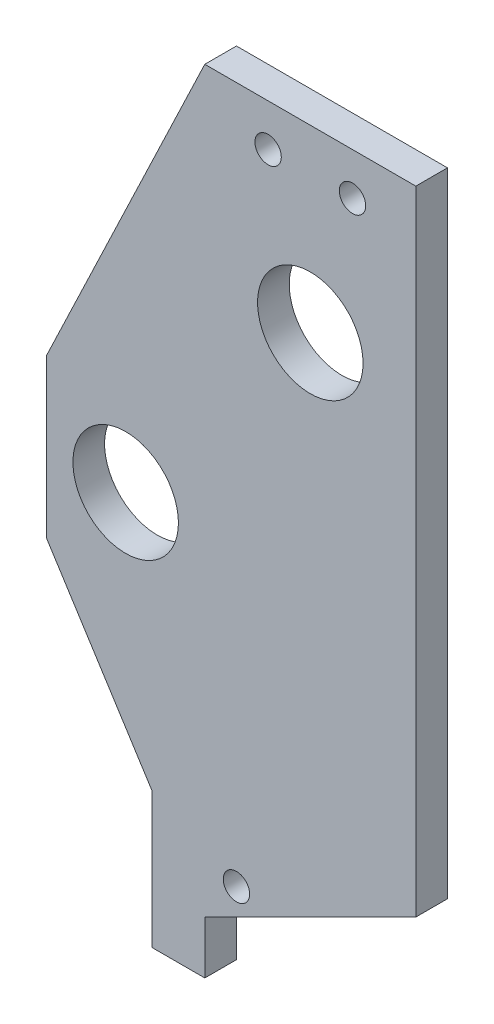
ISO-10303-21;
HEADER;
FILE_DESCRIPTION(('STEP AP214'),'2;1');
FILE_NAME('part.step','',(''),(''),'','','');
FILE_SCHEMA(('AUTOMOTIVE_DESIGN { 1 0 10303 214 1 1 1 1 }'));
ENDSEC;
DATA;
#1=APPLICATION_CONTEXT('core data for automotive mechanical design processes');
#2=APPLICATION_PROTOCOL_DEFINITION('international standard','automotive_design',2000,#1);
#3=PRODUCT_CONTEXT('',#1,'mechanical');
#4=PRODUCT('Part','Part','',(#3));
#5=PRODUCT_RELATED_PRODUCT_CATEGORY('part','',(#4));
#6=PRODUCT_DEFINITION_FORMATION('','',#4);
#7=PRODUCT_DEFINITION_CONTEXT('part definition',#1,'design');
#8=PRODUCT_DEFINITION('design','',#6,#7);
#9=PRODUCT_DEFINITION_SHAPE('','',#8);
#10=(LENGTH_UNIT() NAMED_UNIT(*) SI_UNIT(.MILLI.,.METRE.));
#11=(NAMED_UNIT(*) PLANE_ANGLE_UNIT() SI_UNIT($,.RADIAN.));
#12=(NAMED_UNIT(*) SI_UNIT($,.STERADIAN.) SOLID_ANGLE_UNIT());
#13=UNCERTAINTY_MEASURE_WITH_UNIT(LENGTH_MEASURE(1.E-05),#10,'distance_accuracy_value','');
#14=(GEOMETRIC_REPRESENTATION_CONTEXT(3) GLOBAL_UNCERTAINTY_ASSIGNED_CONTEXT((#13)) GLOBAL_UNIT_ASSIGNED_CONTEXT((#10,
#11,#12)) REPRESENTATION_CONTEXT('',''));
#15=CARTESIAN_POINT('',(0.,0.,0.));
#16=DIRECTION('',(0.,0.,1.));
#17=DIRECTION('',(1.,0.,0.));
#18=AXIS2_PLACEMENT_3D('',#15,#16,#17);
#19=CARTESIAN_POINT('',(-16.2047744499908,-40.1770428914772,0.));
#20=DIRECTION('',(-0.84395586185046,-0.536412624057496,0.));
#21=DIRECTION('',(0.536412624057496,-0.84395586185046,0.));
#22=AXIS2_PLACEMENT_3D('',#19,#20,#21);
#23=PLANE('',#22);
#24=DIRECTION('',(0.536412624057495,-0.843955861850459,0.));
#25=VECTOR('',#24,1.);
#26=CARTESIAN_POINT('',(-16.2047744499908,-40.1770428914772,0.));
#27=LINE('',#26,#25);
#28=CARTESIAN_POINT('',(-31.2047744499908,-16.5770428914772,0.));
#29=VERTEX_POINT('',#28);
#30=CARTESIAN_POINT('',(-21.2047744499908,-32.3103762248105,0.));
#31=VERTEX_POINT('',#30);
#32=EDGE_CURVE('E143',#29,#31,#27,.T.);
#33=ORIENTED_EDGE('',*,*,#32,.T.);
#34=DIRECTION('',(0.,0.,1.));
#35=VECTOR('',#34,1.);
#36=CARTESIAN_POINT('',(-21.2047744499908,-32.3103762248105,0.));
#37=LINE('',#36,#35);
#38=CARTESIAN_POINT('',(-21.2047744499908,-32.3103762248105,3.));
#39=VERTEX_POINT('',#38);
#40=EDGE_CURVE('E183',#31,#39,#37,.T.);
#41=ORIENTED_EDGE('',*,*,#40,.T.);
#42=DIRECTION('',(0.536412624057495,-0.843955861850459,0.));
#43=VECTOR('',#42,1.);
#44=CARTESIAN_POINT('',(-16.2047744499908,-40.1770428914772,3.));
#45=LINE('',#44,#43);
#46=CARTESIAN_POINT('',(-31.2047744499908,-16.5770428914772,3.));
#47=VERTEX_POINT('',#46);
#48=EDGE_CURVE('E139',#47,#39,#45,.T.);
#49=ORIENTED_EDGE('',*,*,#48,.F.);
#50=DIRECTION('',(0.,0.,1.));
#51=VECTOR('',#50,1.);
#52=CARTESIAN_POINT('',(-31.2047744499908,-16.5770428914772,0.));
#53=LINE('',#52,#51);
#54=EDGE_CURVE('E135',#29,#47,#53,.T.);
#55=ORIENTED_EDGE('',*,*,#54,.F.);
#56=EDGE_LOOP('',(#33,#41,#49,#55));
#57=FACE_BOUND('',#56,.T.);
#58=ADVANCED_FACE('F32',(#57),#23,.T.);
#59=CARTESIAN_POINT('',(3.79522555000924,29.8229571085228,3.));
#60=DIRECTION('',(-1.,0.,0.));
#61=DIRECTION('',(0.,-1.,0.));
#62=AXIS2_PLACEMENT_3D('',#59,#60,#61);
#63=PLANE('',#62);
#64=DIRECTION('',(0.,1.,0.));
#65=VECTOR('',#64,1.);
#66=CARTESIAN_POINT('',(3.79522555000924,29.8229571085228,3.));
#67=LINE('',#66,#65);
#68=CARTESIAN_POINT('',(3.79522555000921,-30.1770428914772,3.));
#69=VERTEX_POINT('',#68);
#70=CARTESIAN_POINT('',(3.79522555000924,29.8229571085228,3.));
#71=VERTEX_POINT('',#70);
#72=EDGE_CURVE('E58',#69,#71,#67,.T.);
#73=ORIENTED_EDGE('',*,*,#72,.F.);
#74=DIRECTION('',(0.,0.,1.));
#75=VECTOR('',#74,1.);
#76=CARTESIAN_POINT('',(3.79522555000921,-30.1770428914772,-5.00000000001367E-05));
#77=LINE('',#76,#75);
#78=CARTESIAN_POINT('',(3.79522555000921,-30.1770428914772,0.));
#79=VERTEX_POINT('',#78);
#80=EDGE_CURVE('E105',#79,#69,#77,.T.);
#81=ORIENTED_EDGE('',*,*,#80,.F.);
#82=DIRECTION('',(0.,1.,0.));
#83=VECTOR('',#82,1.);
#84=CARTESIAN_POINT('',(3.79522555000924,29.8229571085228,0.));
#85=LINE('',#84,#83);
#86=CARTESIAN_POINT('',(3.79522555000924,29.8229571085228,0.));
#87=VERTEX_POINT('',#86);
#88=EDGE_CURVE('E129',#79,#87,#85,.T.);
#89=ORIENTED_EDGE('',*,*,#88,.T.);
#90=DIRECTION('',(0.,0.,-1.));
#91=VECTOR('',#90,1.);
#92=CARTESIAN_POINT('',(3.79522555000924,29.8229571085228,3.));
#93=LINE('',#92,#91);
#94=EDGE_CURVE('E41',#71,#87,#93,.T.);
#95=ORIENTED_EDGE('',*,*,#94,.F.);
#96=EDGE_LOOP('',(#73,#81,#89,#95));
#97=FACE_BOUND('',#96,.T.);
#98=ADVANCED_FACE('F34',(#97),#63,.F.);
#99=CARTESIAN_POINT('',(-16.2047744499908,29.8229571085228,3.));
#100=DIRECTION('',(0.,-1.,0.));
#101=DIRECTION('',(0.,0.,-1.));
#102=AXIS2_PLACEMENT_3D('',#99,#100,#101);
#103=PLANE('',#102);
#104=DIRECTION('',(-1.,0.,0.));
#105=VECTOR('',#104,1.);
#106=CARTESIAN_POINT('',(-16.2047744499908,29.8229571085228,0.));
#107=LINE('',#106,#105);
#108=CARTESIAN_POINT('',(-16.2047744499908,29.8229571085228,0.));
#109=VERTEX_POINT('',#108);
#110=EDGE_CURVE('E124',#87,#109,#107,.T.);
#111=ORIENTED_EDGE('',*,*,#110,.T.);
#112=DIRECTION('',(0.,0.,-1.));
#113=VECTOR('',#112,1.);
#114=CARTESIAN_POINT('',(-16.2047744499908,29.8229571085228,3.));
#115=LINE('',#114,#113);
#116=CARTESIAN_POINT('',(-16.2047744499908,29.8229571085228,3.));
#117=VERTEX_POINT('',#116);
#118=EDGE_CURVE('E126',#117,#109,#115,.T.);
#119=ORIENTED_EDGE('',*,*,#118,.F.);
#120=DIRECTION('',(-1.,0.,0.));
#121=VECTOR('',#120,1.);
#122=CARTESIAN_POINT('',(-16.2047744499908,29.8229571085228,3.));
#123=LINE('',#122,#121);
#124=EDGE_CURVE('E123',#71,#117,#123,.T.);
#125=ORIENTED_EDGE('',*,*,#124,.F.);
#126=ORIENTED_EDGE('',*,*,#94,.T.);
#127=EDGE_LOOP('',(#111,#119,#125,#126));
#128=FACE_BOUND('',#127,.T.);
#129=ADVANCED_FACE('F172',(#128),#103,.F.);
#130=CARTESIAN_POINT('',(0.,0.,3.));
#131=DIRECTION('',(0.,0.,1.));
#132=DIRECTION('',(1.,0.,0.));
#133=AXIS2_PLACEMENT_3D('',#130,#131,#132);
#134=PLANE('',#133);
#135=CARTESIAN_POINT('',(-2.20477444999075,25.8229571085228,3.));
#136=DIRECTION('',(0.,0.,1.));
#137=DIRECTION('',(1.,0.,0.));
#138=AXIS2_PLACEMENT_3D('',#135,#136,#137);
#139=CIRCLE('',#138,1.25);
#140=CARTESIAN_POINT('',(-0.954774449990753,25.8229571085228,3.));
#141=VERTEX_POINT('',#140);
#142=EDGE_CURVE('E233',#141,#141,#139,.T.);
#143=ORIENTED_EDGE('',*,*,#142,.F.);
#144=EDGE_LOOP('',(#143));
#145=FACE_BOUND('',#144,.T.);
#146=CARTESIAN_POINT('',(-10.2047744499908,25.8229571085228,3.));
#147=DIRECTION('',(0.,0.,1.));
#148=DIRECTION('',(1.,0.,0.));
#149=AXIS2_PLACEMENT_3D('',#146,#147,#148);
#150=CIRCLE('',#149,1.25);
#151=CARTESIAN_POINT('',(-8.95477444999077,25.8229571085228,3.));
#152=VERTEX_POINT('',#151);
#153=EDGE_CURVE('E223',#152,#152,#150,.T.);
#154=ORIENTED_EDGE('',*,*,#153,.F.);
#155=EDGE_LOOP('',(#154));
#156=FACE_BOUND('',#155,.T.);
#157=CARTESIAN_POINT('',(-6.20477444999076,12.7804501029172,3.));
#158=DIRECTION('',(0.,0.,1.));
#159=DIRECTION('',(1.,0.,0.));
#160=AXIS2_PLACEMENT_3D('',#157,#158,#159);
#161=CIRCLE('',#160,5.);
#162=CARTESIAN_POINT('',(-1.20477444999076,12.7804501029172,3.));
#163=VERTEX_POINT('',#162);
#164=EDGE_CURVE('E220',#163,#163,#161,.T.);
#165=ORIENTED_EDGE('',*,*,#164,.F.);
#166=EDGE_LOOP('',(#165));
#167=FACE_BOUND('',#166,.T.);
#168=CARTESIAN_POINT('',(-13.2047744499908,-36.1770428914772,3.));
#169=DIRECTION('',(0.,0.,1.));
#170=DIRECTION('',(1.,0.,0.));
#171=AXIS2_PLACEMENT_3D('',#168,#169,#170);
#172=CIRCLE('',#171,1.25);
#173=CARTESIAN_POINT('',(-11.9547744499908,-36.1770428914772,3.));
#174=VERTEX_POINT('',#173);
#175=EDGE_CURVE('E217',#174,#174,#172,.T.);
#176=ORIENTED_EDGE('',*,*,#175,.F.);
#177=EDGE_LOOP('',(#176));
#178=FACE_BOUND('',#177,.T.);
#179=CARTESIAN_POINT('',(-23.7047744499908,-9.07704289147717,3.));
#180=DIRECTION('',(0.,0.,1.));
#181=DIRECTION('',(1.,0.,0.));
#182=AXIS2_PLACEMENT_3D('',#179,#180,#181);
#183=CIRCLE('',#182,5.);
#184=CARTESIAN_POINT('',(-18.7047744499908,-9.07704289147717,3.));
#185=VERTEX_POINT('',#184);
#186=EDGE_CURVE('E213',#185,#185,#183,.T.);
#187=ORIENTED_EDGE('',*,*,#186,.F.);
#188=EDGE_LOOP('',(#187));
#189=FACE_BOUND('',#188,.T.);
#190=DIRECTION('',(-0.894427190999916,-0.447213595499958,0.));
#191=VECTOR('',#190,1.);
#192=CARTESIAN_POINT('',(3.79522555000921,-30.1770428914772,3.));
#193=LINE('',#192,#191);
#194=CARTESIAN_POINT('',(-16.2047744499908,-40.1770428914772,3.));
#195=VERTEX_POINT('',#194);
#196=EDGE_CURVE('E107',#69,#195,#193,.T.);
#197=ORIENTED_EDGE('',*,*,#196,.F.);
#198=ORIENTED_EDGE('',*,*,#72,.T.);
#199=ORIENTED_EDGE('',*,*,#124,.T.);
#200=DIRECTION('',(-0.431048720301202,-0.902328654497183,0.));
#201=VECTOR('',#200,1.);
#202=CARTESIAN_POINT('',(-31.2047744499908,-1.57704289147717,3.));
#203=LINE('',#202,#201);
#204=CARTESIAN_POINT('',(-31.2047744499908,-1.57704289147717,3.));
#205=VERTEX_POINT('',#204);
#206=EDGE_CURVE('E154',#117,#205,#203,.T.);
#207=ORIENTED_EDGE('',*,*,#206,.T.);
#208=DIRECTION('',(0.,-1.,0.));
#209=VECTOR('',#208,1.);
#210=CARTESIAN_POINT('',(-31.2047744499908,-16.5770428914772,3.));
#211=LINE('',#210,#209);
#212=EDGE_CURVE('E153',#205,#47,#211,.T.);
#213=ORIENTED_EDGE('',*,*,#212,.T.);
#214=ORIENTED_EDGE('',*,*,#48,.T.);
#215=DIRECTION('',(0.,-1.,0.));
#216=VECTOR('',#215,1.);
#217=CARTESIAN_POINT('',(-21.2047744499907,-45.1770428914772,3.));
#218=LINE('',#217,#216);
#219=CARTESIAN_POINT('',(-21.2047744499907,-45.1770428914772,3.));
#220=VERTEX_POINT('',#219);
#221=EDGE_CURVE('E49',#39,#220,#218,.T.);
#222=ORIENTED_EDGE('',*,*,#221,.T.);
#223=DIRECTION('',(1.,0.,0.));
#224=VECTOR('',#223,1.);
#225=CARTESIAN_POINT('',(-16.2047744499907,-45.1770428914772,3.));
#226=LINE('',#225,#224);
#227=CARTESIAN_POINT('',(-16.2047744499907,-45.1770428914772,3.));
#228=VERTEX_POINT('',#227);
#229=EDGE_CURVE('E199',#220,#228,#226,.T.);
#230=ORIENTED_EDGE('',*,*,#229,.T.);
#231=DIRECTION('',(0.,1.,0.));
#232=VECTOR('',#231,1.);
#233=CARTESIAN_POINT('',(-16.2047744499908,-40.1770428914772,3.));
#234=LINE('',#233,#232);
#235=EDGE_CURVE('E118',#228,#195,#234,.T.);
#236=ORIENTED_EDGE('',*,*,#235,.T.);
#237=EDGE_LOOP('',(#197,#198,#199,#207,#213,#214,#222,#230,#236));
#238=FACE_BOUND('',#237,.T.);
#239=ADVANCED_FACE('F115',(#145,#156,#167,#178,#189,#238),#134,.T.);
#240=CARTESIAN_POINT('',(0.,0.,0.));
#241=DIRECTION('',(0.,0.,1.));
#242=DIRECTION('',(1.,0.,0.));
#243=AXIS2_PLACEMENT_3D('',#240,#241,#242);
#244=PLANE('',#243);
#245=CARTESIAN_POINT('',(-2.20477444999075,25.8229571085228,0.));
#246=DIRECTION('',(0.,0.,1.));
#247=DIRECTION('',(1.,0.,0.));
#248=AXIS2_PLACEMENT_3D('',#245,#246,#247);
#249=CIRCLE('',#248,1.25);
#250=CARTESIAN_POINT('',(-0.954774449990753,25.8229571085228,0.));
#251=VERTEX_POINT('',#250);
#252=EDGE_CURVE('E36',#251,#251,#249,.T.);
#253=ORIENTED_EDGE('',*,*,#252,.T.);
#254=EDGE_LOOP('',(#253));
#255=FACE_BOUND('',#254,.T.);
#256=CARTESIAN_POINT('',(-10.2047744499908,25.8229571085228,0.));
#257=DIRECTION('',(0.,0.,1.));
#258=DIRECTION('',(1.,0.,0.));
#259=AXIS2_PLACEMENT_3D('',#256,#257,#258);
#260=CIRCLE('',#259,1.25);
#261=CARTESIAN_POINT('',(-8.95477444999077,25.8229571085228,0.));
#262=VERTEX_POINT('',#261);
#263=EDGE_CURVE('E221',#262,#262,#260,.T.);
#264=ORIENTED_EDGE('',*,*,#263,.T.);
#265=EDGE_LOOP('',(#264));
#266=FACE_BOUND('',#265,.T.);
#267=CARTESIAN_POINT('',(-6.20477444999076,12.7804501029172,0.));
#268=DIRECTION('',(0.,0.,1.));
#269=DIRECTION('',(1.,0.,0.));
#270=AXIS2_PLACEMENT_3D('',#267,#268,#269);
#271=CIRCLE('',#270,5.);
#272=CARTESIAN_POINT('',(-1.20477444999076,12.7804501029172,0.));
#273=VERTEX_POINT('',#272);
#274=EDGE_CURVE('E218',#273,#273,#271,.T.);
#275=ORIENTED_EDGE('',*,*,#274,.T.);
#276=EDGE_LOOP('',(#275));
#277=FACE_BOUND('',#276,.T.);
#278=CARTESIAN_POINT('',(-13.2047744499908,-36.1770428914772,0.));
#279=DIRECTION('',(0.,0.,1.));
#280=DIRECTION('',(1.,0.,0.));
#281=AXIS2_PLACEMENT_3D('',#278,#279,#280);
#282=CIRCLE('',#281,1.25);
#283=CARTESIAN_POINT('',(-11.9547744499908,-36.1770428914772,0.));
#284=VERTEX_POINT('',#283);
#285=EDGE_CURVE('E214',#284,#284,#282,.T.);
#286=ORIENTED_EDGE('',*,*,#285,.T.);
#287=EDGE_LOOP('',(#286));
#288=FACE_BOUND('',#287,.T.);
#289=CARTESIAN_POINT('',(-23.7047744499908,-9.07704289147717,0.));
#290=DIRECTION('',(0.,0.,1.));
#291=DIRECTION('',(1.,0.,0.));
#292=AXIS2_PLACEMENT_3D('',#289,#290,#291);
#293=CIRCLE('',#292,5.);
#294=CARTESIAN_POINT('',(-18.7047744499908,-9.07704289147717,0.));
#295=VERTEX_POINT('',#294);
#296=EDGE_CURVE('E119',#295,#295,#293,.T.);
#297=ORIENTED_EDGE('',*,*,#296,.T.);
#298=EDGE_LOOP('',(#297));
#299=FACE_BOUND('',#298,.T.);
#300=ORIENTED_EDGE('',*,*,#88,.F.);
#301=DIRECTION('',(-0.894427190999916,-0.447213595499958,0.));
#302=VECTOR('',#301,1.);
#303=CARTESIAN_POINT('',(12.8298622665927,-25.6597245331854,0.));
#304=LINE('',#303,#302);
#305=CARTESIAN_POINT('',(-16.2047744499908,-40.1770428914772,-2.5E-06));
#306=VERTEX_POINT('',#305);
#307=EDGE_CURVE('E110',#79,#306,#304,.T.);
#308=ORIENTED_EDGE('',*,*,#307,.T.);
#309=DIRECTION('',(0.,1.,0.));
#310=VECTOR('',#309,1.);
#311=CARTESIAN_POINT('',(-16.2047744499908,-40.1770428914772,0.));
#312=LINE('',#311,#310);
#313=CARTESIAN_POINT('',(-16.2047744499907,-45.1770428914772,0.));
#314=VERTEX_POINT('',#313);
#315=EDGE_CURVE('E185',#314,#306,#312,.T.);
#316=ORIENTED_EDGE('',*,*,#315,.F.);
#317=DIRECTION('',(1.,0.,0.));
#318=VECTOR('',#317,1.);
#319=CARTESIAN_POINT('',(-16.2047744499907,-45.1770428914772,0.));
#320=LINE('',#319,#318);
#321=CARTESIAN_POINT('',(-21.2047744499907,-45.1770428914772,0.));
#322=VERTEX_POINT('',#321);
#323=EDGE_CURVE('E189',#322,#314,#320,.T.);
#324=ORIENTED_EDGE('',*,*,#323,.F.);
#325=DIRECTION('',(0.,-1.,0.));
#326=VECTOR('',#325,1.);
#327=CARTESIAN_POINT('',(-21.2047744499907,-45.1770428914772,0.));
#328=LINE('',#327,#326);
#329=EDGE_CURVE('E181',#31,#322,#328,.T.);
#330=ORIENTED_EDGE('',*,*,#329,.F.);
#331=ORIENTED_EDGE('',*,*,#32,.F.);
#332=DIRECTION('',(0.,-1.,0.));
#333=VECTOR('',#332,1.);
#334=CARTESIAN_POINT('',(-31.2047744499908,-16.5770428914772,0.));
#335=LINE('',#334,#333);
#336=CARTESIAN_POINT('',(-31.2047744499908,-1.57704289147717,0.));
#337=VERTEX_POINT('',#336);
#338=EDGE_CURVE('E156',#337,#29,#335,.T.);
#339=ORIENTED_EDGE('',*,*,#338,.F.);
#340=DIRECTION('',(-0.431048720301202,-0.902328654497183,0.));
#341=VECTOR('',#340,1.);
#342=CARTESIAN_POINT('',(-31.2047744499908,-1.57704289147717,0.));
#343=LINE('',#342,#341);
#344=EDGE_CURVE('E151',#109,#337,#343,.T.);
#345=ORIENTED_EDGE('',*,*,#344,.F.);
#346=ORIENTED_EDGE('',*,*,#110,.F.);
#347=EDGE_LOOP('',(#300,#308,#316,#324,#330,#331,#339,#345,#346));
#348=FACE_BOUND('',#347,.T.);
#349=ADVANCED_FACE('F175',(#255,#266,#277,#288,#299,#348),#244,.F.);
#350=CARTESIAN_POINT('',(-31.2047744499908,-16.5770428914772,0.));
#351=DIRECTION('',(-1.,0.,0.));
#352=DIRECTION('',(0.,0.,1.));
#353=AXIS2_PLACEMENT_3D('',#350,#351,#352);
#354=PLANE('',#353);
#355=ORIENTED_EDGE('',*,*,#212,.F.);
#356=DIRECTION('',(0.,0.,1.));
#357=VECTOR('',#356,1.);
#358=CARTESIAN_POINT('',(-31.2047744499908,-1.57704289147717,0.));
#359=LINE('',#358,#357);
#360=EDGE_CURVE('E132',#337,#205,#359,.T.);
#361=ORIENTED_EDGE('',*,*,#360,.F.);
#362=ORIENTED_EDGE('',*,*,#338,.T.);
#363=ORIENTED_EDGE('',*,*,#54,.T.);
#364=EDGE_LOOP('',(#355,#361,#362,#363));
#365=FACE_BOUND('',#364,.T.);
#366=ADVANCED_FACE('F169',(#365),#354,.T.);
#367=CARTESIAN_POINT('',(-31.2047744499908,-1.57704289147717,0.));
#368=DIRECTION('',(-0.902328654497183,0.431048720301202,0.));
#369=DIRECTION('',(-0.431048720301202,-0.902328654497183,0.));
#370=AXIS2_PLACEMENT_3D('',#367,#368,#369);
#371=PLANE('',#370);
#372=ORIENTED_EDGE('',*,*,#206,.F.);
#373=ORIENTED_EDGE('',*,*,#118,.T.);
#374=ORIENTED_EDGE('',*,*,#344,.T.);
#375=ORIENTED_EDGE('',*,*,#360,.T.);
#376=EDGE_LOOP('',(#372,#373,#374,#375));
#377=FACE_BOUND('',#376,.T.);
#378=ADVANCED_FACE('F166',(#377),#371,.T.);
#379=CARTESIAN_POINT('',(-16.2047744499908,-40.1770428914772,0.));
#380=DIRECTION('',(1.,0.,0.));
#381=DIRECTION('',(0.,1.,0.));
#382=AXIS2_PLACEMENT_3D('',#379,#380,#381);
#383=PLANE('',#382);
#384=ORIENTED_EDGE('',*,*,#235,.F.);
#385=DIRECTION('',(0.,0.,1.));
#386=VECTOR('',#385,1.);
#387=CARTESIAN_POINT('',(-16.2047744499907,-45.1770428914772,0.));
#388=LINE('',#387,#386);
#389=EDGE_CURVE('E144',#314,#228,#388,.T.);
#390=ORIENTED_EDGE('',*,*,#389,.F.);
#391=ORIENTED_EDGE('',*,*,#315,.T.);
#392=DIRECTION('',(0.,0.,-1.));
#393=VECTOR('',#392,1.);
#394=CARTESIAN_POINT('',(-16.2047744499908,-40.1770428914772,3.));
#395=LINE('',#394,#393);
#396=EDGE_CURVE('E11',#195,#306,#395,.T.);
#397=ORIENTED_EDGE('',*,*,#396,.F.);
#398=EDGE_LOOP('',(#384,#390,#391,#397));
#399=FACE_BOUND('',#398,.T.);
#400=ADVANCED_FACE('F266',(#399),#383,.T.);
#401=CARTESIAN_POINT('',(-16.2047744499907,-45.1770428914772,0.));
#402=DIRECTION('',(0.,-1.,0.));
#403=DIRECTION('',(0.,0.,-1.));
#404=AXIS2_PLACEMENT_3D('',#401,#402,#403);
#405=PLANE('',#404);
#406=ORIENTED_EDGE('',*,*,#229,.F.);
#407=DIRECTION('',(0.,0.,1.));
#408=VECTOR('',#407,1.);
#409=CARTESIAN_POINT('',(-21.2047744499907,-45.1770428914772,0.));
#410=LINE('',#409,#408);
#411=EDGE_CURVE('E184',#322,#220,#410,.T.);
#412=ORIENTED_EDGE('',*,*,#411,.F.);
#413=ORIENTED_EDGE('',*,*,#323,.T.);
#414=ORIENTED_EDGE('',*,*,#389,.T.);
#415=EDGE_LOOP('',(#406,#412,#413,#414));
#416=FACE_BOUND('',#415,.T.);
#417=ADVANCED_FACE('F283',(#416),#405,.T.);
#418=CARTESIAN_POINT('',(-21.2047744499907,-45.1770428914772,0.));
#419=DIRECTION('',(-1.,0.,0.));
#420=DIRECTION('',(0.,-1.,0.));
#421=AXIS2_PLACEMENT_3D('',#418,#419,#420);
#422=PLANE('',#421);
#423=ORIENTED_EDGE('',*,*,#221,.F.);
#424=ORIENTED_EDGE('',*,*,#40,.F.);
#425=ORIENTED_EDGE('',*,*,#329,.T.);
#426=ORIENTED_EDGE('',*,*,#411,.T.);
#427=EDGE_LOOP('',(#423,#424,#425,#426));
#428=FACE_BOUND('',#427,.T.);
#429=ADVANCED_FACE('F263',(#428),#422,.T.);
#430=CARTESIAN_POINT('',(3.79522555000921,-30.1770428914772,-5.00000000001367E-05));
#431=DIRECTION('',(-0.447213595499958,0.894427190999916,0.));
#432=DIRECTION('',(-0.894427190999916,-0.447213595499958,0.));
#433=AXIS2_PLACEMENT_3D('',#430,#431,#432);
#434=PLANE('',#433);
#435=ORIENTED_EDGE('',*,*,#80,.T.);
#436=ORIENTED_EDGE('',*,*,#196,.T.);
#437=ORIENTED_EDGE('',*,*,#396,.T.);
#438=ORIENTED_EDGE('',*,*,#307,.F.);
#439=EDGE_LOOP('',(#435,#436,#437,#438));
#440=FACE_BOUND('',#439,.T.);
#441=ADVANCED_FACE('F106',(#440),#434,.F.);
#442=CARTESIAN_POINT('',(-23.7047744499908,-9.07704289147717,-5.00000000001367E-05));
#443=DIRECTION('',(0.,0.,1.));
#444=DIRECTION('',(1.,0.,0.));
#445=AXIS2_PLACEMENT_3D('',#442,#443,#444);
#446=CYLINDRICAL_SURFACE('',#445,5.);
#447=ORIENTED_EDGE('',*,*,#186,.T.);
#448=EDGE_LOOP('',(#447));
#449=FACE_BOUND('',#448,.T.);
#450=ORIENTED_EDGE('',*,*,#296,.F.);
#451=EDGE_LOOP('',(#450));
#452=FACE_BOUND('',#451,.T.);
#453=ADVANCED_FACE('F241',(#449,#452),#446,.F.);
#454=CARTESIAN_POINT('',(-13.2047744499908,-36.1770428914772,-5.00000000001367E-05));
#455=DIRECTION('',(0.,0.,1.));
#456=DIRECTION('',(1.,0.,0.));
#457=AXIS2_PLACEMENT_3D('',#454,#455,#456);
#458=CYLINDRICAL_SURFACE('',#457,1.25);
#459=ORIENTED_EDGE('',*,*,#175,.T.);
#460=EDGE_LOOP('',(#459));
#461=FACE_BOUND('',#460,.T.);
#462=ORIENTED_EDGE('',*,*,#285,.F.);
#463=EDGE_LOOP('',(#462));
#464=FACE_BOUND('',#463,.T.);
#465=ADVANCED_FACE('F309',(#461,#464),#458,.F.);
#466=CARTESIAN_POINT('',(-6.20477444999076,12.7804501029172,-5.00000000001367E-05));
#467=DIRECTION('',(0.,0.,1.));
#468=DIRECTION('',(1.,0.,0.));
#469=AXIS2_PLACEMENT_3D('',#466,#467,#468);
#470=CYLINDRICAL_SURFACE('',#469,5.);
#471=ORIENTED_EDGE('',*,*,#164,.T.);
#472=EDGE_LOOP('',(#471));
#473=FACE_BOUND('',#472,.T.);
#474=ORIENTED_EDGE('',*,*,#274,.F.);
#475=EDGE_LOOP('',(#474));
#476=FACE_BOUND('',#475,.T.);
#477=ADVANCED_FACE('F316',(#473,#476),#470,.F.);
#478=CARTESIAN_POINT('',(-10.2047744499908,25.8229571085228,-5.00000000001367E-05));
#479=DIRECTION('',(0.,0.,1.));
#480=DIRECTION('',(1.,0.,0.));
#481=AXIS2_PLACEMENT_3D('',#478,#479,#480);
#482=CYLINDRICAL_SURFACE('',#481,1.25);
#483=ORIENTED_EDGE('',*,*,#153,.T.);
#484=EDGE_LOOP('',(#483));
#485=FACE_BOUND('',#484,.T.);
#486=ORIENTED_EDGE('',*,*,#263,.F.);
#487=EDGE_LOOP('',(#486));
#488=FACE_BOUND('',#487,.T.);
#489=ADVANCED_FACE('F324',(#485,#488),#482,.F.);
#490=CARTESIAN_POINT('',(-2.20477444999075,25.8229571085228,-5.00000000001367E-05));
#491=DIRECTION('',(0.,0.,1.));
#492=DIRECTION('',(1.,0.,0.));
#493=AXIS2_PLACEMENT_3D('',#490,#491,#492);
#494=CYLINDRICAL_SURFACE('',#493,1.25);
#495=ORIENTED_EDGE('',*,*,#142,.T.);
#496=EDGE_LOOP('',(#495));
#497=FACE_BOUND('',#496,.T.);
#498=ORIENTED_EDGE('',*,*,#252,.F.);
#499=EDGE_LOOP('',(#498));
#500=FACE_BOUND('',#499,.T.);
#501=ADVANCED_FACE('F332',(#497,#500),#494,.F.);
#502=CLOSED_SHELL('',(#58,#98,#129,#239,#349,#366,#378,#400,#417,#429,#441,#453,#465,#477,#489,#501));
#503=MANIFOLD_SOLID_BREP('B2',#502);
#504=ADVANCED_BREP_SHAPE_REPRESENTATION('',(#18,#503),#14);
#505=SHAPE_DEFINITION_REPRESENTATION(#9,#504);
ENDSEC;
END-ISO-10303-21;
